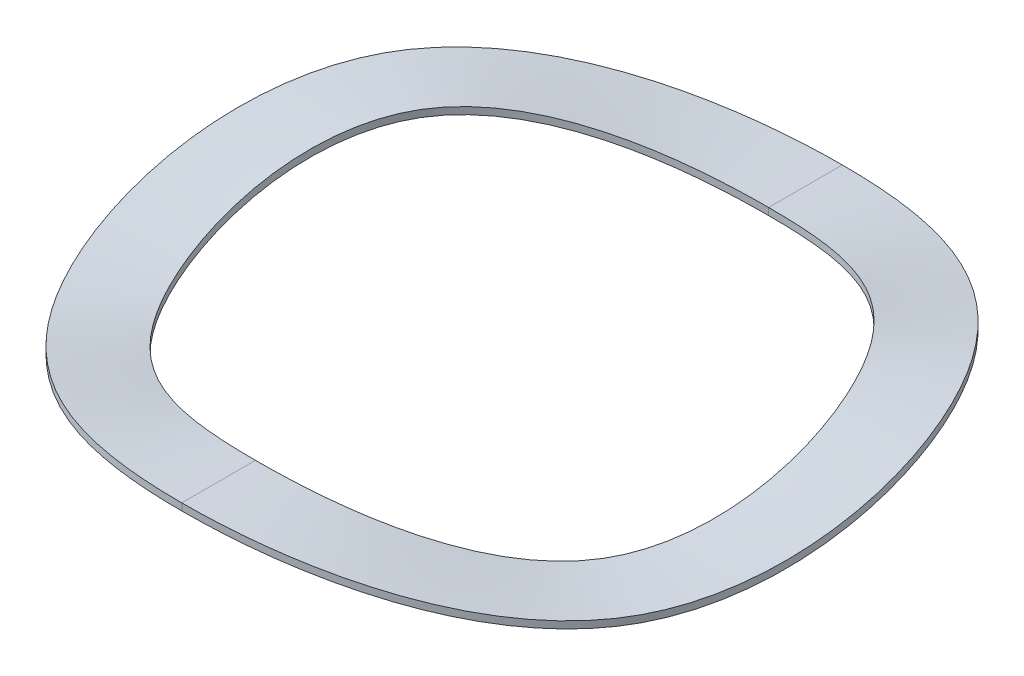
ISO-10303-21;
HEADER;
FILE_DESCRIPTION(('STEP AP214'),'2;1');
FILE_NAME('part.step','',(''),(''),'','','');
FILE_SCHEMA(('AUTOMOTIVE_DESIGN { 1 0 10303 214 1 1 1 1 }'));
ENDSEC;
DATA;
#1=APPLICATION_CONTEXT('core data for automotive mechanical design processes');
#2=APPLICATION_PROTOCOL_DEFINITION('international standard','automotive_design',2000,#1);
#3=PRODUCT_CONTEXT('',#1,'mechanical');
#4=PRODUCT('Part','Part','',(#3));
#5=PRODUCT_RELATED_PRODUCT_CATEGORY('part','',(#4));
#6=PRODUCT_DEFINITION_FORMATION('','',#4);
#7=PRODUCT_DEFINITION_CONTEXT('part definition',#1,'design');
#8=PRODUCT_DEFINITION('design','',#6,#7);
#9=PRODUCT_DEFINITION_SHAPE('','',#8);
#10=(LENGTH_UNIT() NAMED_UNIT(*) SI_UNIT(.MILLI.,.METRE.));
#11=(NAMED_UNIT(*) PLANE_ANGLE_UNIT() SI_UNIT($,.RADIAN.));
#12=(NAMED_UNIT(*) SI_UNIT($,.STERADIAN.) SOLID_ANGLE_UNIT());
#13=UNCERTAINTY_MEASURE_WITH_UNIT(LENGTH_MEASURE(1.E-05),#10,'distance_accuracy_value','');
#14=(GEOMETRIC_REPRESENTATION_CONTEXT(3) GLOBAL_UNCERTAINTY_ASSIGNED_CONTEXT((#13)) GLOBAL_UNIT_ASSIGNED_CONTEXT((#10,
#11,#12)) REPRESENTATION_CONTEXT('',''));
#15=CARTESIAN_POINT('',(0.,0.,0.));
#16=DIRECTION('',(0.,0.,1.));
#17=DIRECTION('',(1.,0.,0.));
#18=AXIS2_PLACEMENT_3D('',#15,#16,#17);
#19=CARTESIAN_POINT('',(0.,0.2921,-10.6553));
#20=CARTESIAN_POINT('',(3.69110419397773,0.2921,-10.6553));
#21=CARTESIAN_POINT('',(11.0733125819332,3.4163,-6.39318));
#22=CARTESIAN_POINT('',(11.0733125819332,-1.27,6.39318));
#23=CARTESIAN_POINT('',(3.69110419397772,1.8542,10.6553));
#24=CARTESIAN_POINT('',(0.,1.8542,10.6553));
#25=CARTESIAN_POINT('',(0.,0.194733333333333,-10.6553));
#26=CARTESIAN_POINT('',(3.69110419397773,0.194733333333332,-10.6553));
#27=CARTESIAN_POINT('',(11.0733125819332,3.31893333333334,-6.39318));
#28=CARTESIAN_POINT('',(11.0733125819332,-1.36736666666666,6.39318));
#29=CARTESIAN_POINT('',(3.69110419397772,1.75683333333333,10.6553));
#30=CARTESIAN_POINT('',(0.,1.75683333333333,10.6553));
#31=CARTESIAN_POINT('',(0.,0.0973666666666658,-10.6553));
#32=CARTESIAN_POINT('',(3.69110419397773,0.0973666666666655,-10.6553));
#33=CARTESIAN_POINT('',(11.0733125819332,3.22156666666667,-6.39318));
#34=CARTESIAN_POINT('',(11.0733125819332,-1.46473333333333,6.39318));
#35=CARTESIAN_POINT('',(3.69110419397772,1.65946666666667,10.6553));
#36=CARTESIAN_POINT('',(0.,1.65946666666667,10.6553));
#37=CARTESIAN_POINT('',(0.,0.,-10.6553));
#38=CARTESIAN_POINT('',(3.69110419397773,0.,-10.6553));
#39=CARTESIAN_POINT('',(11.0733125819332,3.1242,-6.39318));
#40=CARTESIAN_POINT('',(11.0733125819332,-1.5621,6.39318));
#41=CARTESIAN_POINT('',(3.69110419397772,1.5621,10.6553));
#42=CARTESIAN_POINT('',(0.,1.5621,10.6553));
#43=(BOUNDED_SURFACE() B_SPLINE_SURFACE(3,3,((#19,#20,#21,#22,#23,#24),(#25,#26,#27,#28,#29,
#30),(#31,#32,#33,#34,#35,#36),(#37,#38,#39,#40,#41,#42)),.UNSPECIFIED.,.F.,.F.,
.F.) B_SPLINE_SURFACE_WITH_KNOTS((4,4),(4,1,1,4),(0.,1.),(0.,0.166666666666668,
0.333333333333334,0.5),
.UNSPECIFIED.) GEOMETRIC_REPRESENTATION_ITEM() RATIONAL_B_SPLINE_SURFACE(((1.,1.,1.,1.,1.,1.),
(1.,1.,1.,1.,1.,1.),(1.,1.,1.,1.,1.,1.),(1.,1.,1.,1.,1.,1.))) REPRESENTATION_ITEM('') SURFACE());
#44=CARTESIAN_POINT('',(0.,1.8542,10.6553));
#45=CARTESIAN_POINT('',(0.,1.75683333333333,10.6553));
#46=CARTESIAN_POINT('',(0.,1.65946666666667,10.6553));
#47=CARTESIAN_POINT('',(0.,1.5621,10.6553));
#48=(BOUNDED_CURVE() B_SPLINE_CURVE(3,(#44,#45,#46,#47),.UNSPECIFIED.,.F.,
.F.) B_SPLINE_CURVE_WITH_KNOTS((4,4),(0.,1.),
.UNSPECIFIED.) CURVE() GEOMETRIC_REPRESENTATION_ITEM() RATIONAL_B_SPLINE_CURVE((1.,1.,1.,1.)) REPRESENTATION_ITEM(''));
#49=CARTESIAN_POINT('',(0.,1.8542,10.6553));
#50=VERTEX_POINT('',#49);
#51=CARTESIAN_POINT('',(0.,1.5621,10.6553));
#52=VERTEX_POINT('',#51);
#53=EDGE_CURVE('E118',#50,#52,#48,.T.);
#54=CARTESIAN_POINT('',(0.,0.2921,-10.6553));
#55=CARTESIAN_POINT('',(3.69110419397773,0.2921,-10.6553));
#56=CARTESIAN_POINT('',(11.0733125819332,3.4163,-6.39318));
#57=CARTESIAN_POINT('',(11.0733125819332,-1.27,6.39318));
#58=CARTESIAN_POINT('',(3.69110419397772,1.8542,10.6553));
#59=CARTESIAN_POINT('',(0.,1.8542,10.6553));
#60=(BOUNDED_CURVE() B_SPLINE_CURVE(3,(#54,#55,#56,#57,#58,#59),.UNSPECIFIED.,.F.,
.F.) B_SPLINE_CURVE_WITH_KNOTS((4,1,1,4),(0.,0.166666666666668,0.333333333333334,0.5),
.UNSPECIFIED.) CURVE() GEOMETRIC_REPRESENTATION_ITEM() RATIONAL_B_SPLINE_CURVE((1.,1.,1.,1.,1.,1.)) REPRESENTATION_ITEM(''));
#61=CARTESIAN_POINT('',(0.,0.2921,-10.6553));
#62=VERTEX_POINT('',#61);
#63=EDGE_CURVE('E11',#62,#50,#60,.T.);
#64=CARTESIAN_POINT('',(0.,0.2921,-10.6553));
#65=CARTESIAN_POINT('',(0.,0.194733333333333,-10.6553));
#66=CARTESIAN_POINT('',(0.,0.0973666666666658,-10.6553));
#67=CARTESIAN_POINT('',(0.,0.,-10.6553));
#68=(BOUNDED_CURVE() B_SPLINE_CURVE(3,(#64,#65,#66,#67),.UNSPECIFIED.,.F.,
.F.) B_SPLINE_CURVE_WITH_KNOTS((4,4),(0.,1.),
.UNSPECIFIED.) CURVE() GEOMETRIC_REPRESENTATION_ITEM() RATIONAL_B_SPLINE_CURVE((1.,1.,1.,1.)) REPRESENTATION_ITEM(''));
#69=CARTESIAN_POINT('',(0.,0.,-10.6553));
#70=VERTEX_POINT('',#69);
#71=EDGE_CURVE('E98',#62,#70,#68,.T.);
#72=CARTESIAN_POINT('',(0.,0.,-10.6553));
#73=CARTESIAN_POINT('',(3.69110419397773,0.,-10.6553));
#74=CARTESIAN_POINT('',(11.0733125819332,3.1242,-6.39318));
#75=CARTESIAN_POINT('',(11.0733125819332,-1.5621,6.39318));
#76=CARTESIAN_POINT('',(3.69110419397772,1.5621,10.6553));
#77=CARTESIAN_POINT('',(0.,1.5621,10.6553));
#78=(BOUNDED_CURVE() B_SPLINE_CURVE(3,(#72,#73,#74,#75,#76,#77),.UNSPECIFIED.,.F.,
.F.) B_SPLINE_CURVE_WITH_KNOTS((4,1,1,4),(0.,0.166666666666668,0.333333333333334,0.5),
.UNSPECIFIED.) CURVE() GEOMETRIC_REPRESENTATION_ITEM() RATIONAL_B_SPLINE_CURVE((1.,1.,1.,1.,1.,1.)) REPRESENTATION_ITEM(''));
#79=EDGE_CURVE('E31',#70,#52,#78,.T.);
#80=ORIENTED_EDGE('',*,*,#53,.F.);
#81=ORIENTED_EDGE('',*,*,#63,.F.);
#82=ORIENTED_EDGE('',*,*,#71,.T.);
#83=ORIENTED_EDGE('',*,*,#79,.T.);
#84=EDGE_LOOP('',(#80,#81,#82,#83));
#85=FACE_BOUND('',#84,.T.);
#86=ADVANCED_FACE('F16',(#85),#43,.T.);
#87=CARTESIAN_POINT('',(0.,0.2921,-13.716));
#88=CARTESIAN_POINT('',(4.75136177532294,0.2921,-13.716));
#89=CARTESIAN_POINT('',(14.2540853259689,3.4163,-8.2296));
#90=CARTESIAN_POINT('',(14.2540853259688,-1.27,8.2296));
#91=CARTESIAN_POINT('',(4.75136177532294,1.8542,13.716));
#92=CARTESIAN_POINT('',(0.,1.8542,13.716));
#93=CARTESIAN_POINT('',(0.,0.2921,-12.6957666666667));
#94=CARTESIAN_POINT('',(4.3979425815412,0.2921,-12.6957666666667));
#95=CARTESIAN_POINT('',(13.1938277446236,3.4163,-7.61746));
#96=CARTESIAN_POINT('',(13.1938277446236,-1.27,7.61746));
#97=CARTESIAN_POINT('',(4.3979425815412,1.8542,12.6957666666667));
#98=CARTESIAN_POINT('',(0.,1.8542,12.6957666666667));
#99=CARTESIAN_POINT('',(0.,0.2921,-11.6755333333333));
#100=CARTESIAN_POINT('',(4.04452338775946,0.2921,-11.6755333333333));
#101=CARTESIAN_POINT('',(12.1335701632784,3.4163,-7.00532));
#102=CARTESIAN_POINT('',(12.1335701632784,-1.27,7.00532));
#103=CARTESIAN_POINT('',(4.04452338775946,1.8542,11.6755333333333));
#104=CARTESIAN_POINT('',(0.,1.8542,11.6755333333333));
#105=CARTESIAN_POINT('',(0.,0.2921,-10.6553));
#106=CARTESIAN_POINT('',(3.69110419397773,0.2921,-10.6553));
#107=CARTESIAN_POINT('',(11.0733125819332,3.4163,-6.39318));
#108=CARTESIAN_POINT('',(11.0733125819332,-1.27,6.39318));
#109=CARTESIAN_POINT('',(3.69110419397772,1.8542,10.6553));
#110=CARTESIAN_POINT('',(0.,1.8542,10.6553));
#111=(BOUNDED_SURFACE() B_SPLINE_SURFACE(3,3,((#87,#88,#89,#90,#91,#92),(#93,#94,#95,#96,#97,
#98),(#99,#100,#101,#102,#103,#104),(#105,#106,#107,#108,#109,#110)),.UNSPECIFIED.,.F.,.F.,
.F.) B_SPLINE_SURFACE_WITH_KNOTS((4,4),(4,1,1,4),(0.,1.),(0.,0.166666666666668,
0.333333333333334,0.5),
.UNSPECIFIED.) GEOMETRIC_REPRESENTATION_ITEM() RATIONAL_B_SPLINE_SURFACE(((1.,1.,1.,1.,1.,1.),
(1.,1.,1.,1.,1.,1.),(1.,1.,1.,1.,1.,1.),(1.,1.,1.,1.,1.,1.))) REPRESENTATION_ITEM('') SURFACE());
#112=CARTESIAN_POINT('',(0.,1.8542,13.716));
#113=CARTESIAN_POINT('',(0.,1.8542,12.6957666666667));
#114=CARTESIAN_POINT('',(0.,1.8542,11.6755333333333));
#115=CARTESIAN_POINT('',(0.,1.8542,10.6553));
#116=(BOUNDED_CURVE() B_SPLINE_CURVE(3,(#112,#113,#114,#115),.UNSPECIFIED.,.F.,
.F.) B_SPLINE_CURVE_WITH_KNOTS((4,4),(0.,1.),
.UNSPECIFIED.) CURVE() GEOMETRIC_REPRESENTATION_ITEM() RATIONAL_B_SPLINE_CURVE((1.,1.,1.,1.)) REPRESENTATION_ITEM(''));
#117=CARTESIAN_POINT('',(0.,1.8542,13.716));
#118=VERTEX_POINT('',#117);
#119=EDGE_CURVE('E22',#118,#50,#116,.T.);
#120=CARTESIAN_POINT('',(0.,0.2921,-13.716));
#121=CARTESIAN_POINT('',(4.75136177532294,0.2921,-13.716));
#122=CARTESIAN_POINT('',(14.2540853259689,3.4163,-8.2296));
#123=CARTESIAN_POINT('',(14.2540853259688,-1.27,8.2296));
#124=CARTESIAN_POINT('',(4.75136177532294,1.8542,13.716));
#125=CARTESIAN_POINT('',(0.,1.8542,13.716));
#126=(BOUNDED_CURVE() B_SPLINE_CURVE(3,(#120,#121,#122,#123,#124,#125),.UNSPECIFIED.,.F.,
.F.) B_SPLINE_CURVE_WITH_KNOTS((4,1,1,4),(0.,0.166666666666668,0.333333333333334,0.5),
.UNSPECIFIED.) CURVE() GEOMETRIC_REPRESENTATION_ITEM() RATIONAL_B_SPLINE_CURVE((1.,1.,1.,1.,1.,1.)) REPRESENTATION_ITEM(''));
#127=CARTESIAN_POINT('',(0.,0.2921,-13.716));
#128=VERTEX_POINT('',#127);
#129=EDGE_CURVE('E67',#128,#118,#126,.T.);
#130=CARTESIAN_POINT('',(0.,0.2921,-13.716));
#131=CARTESIAN_POINT('',(0.,0.2921,-12.6957666666667));
#132=CARTESIAN_POINT('',(0.,0.2921,-11.6755333333333));
#133=CARTESIAN_POINT('',(0.,0.2921,-10.6553));
#134=(BOUNDED_CURVE() B_SPLINE_CURVE(3,(#130,#131,#132,#133),.UNSPECIFIED.,.F.,
.F.) B_SPLINE_CURVE_WITH_KNOTS((4,4),(0.,1.),
.UNSPECIFIED.) CURVE() GEOMETRIC_REPRESENTATION_ITEM() RATIONAL_B_SPLINE_CURVE((1.,1.,1.,1.)) REPRESENTATION_ITEM(''));
#135=EDGE_CURVE('E71',#128,#62,#134,.T.);
#136=ORIENTED_EDGE('',*,*,#119,.F.);
#137=ORIENTED_EDGE('',*,*,#129,.F.);
#138=ORIENTED_EDGE('',*,*,#135,.T.);
#139=ORIENTED_EDGE('',*,*,#63,.T.);
#140=EDGE_LOOP('',(#136,#137,#138,#139));
#141=FACE_BOUND('',#140,.T.);
#142=ADVANCED_FACE('F68',(#141),#111,.T.);
#143=CARTESIAN_POINT('',(0.,0.,-10.6553));
#144=CARTESIAN_POINT('',(3.69110419397773,0.,-10.6553));
#145=CARTESIAN_POINT('',(11.0733125819332,3.1242,-6.39318));
#146=CARTESIAN_POINT('',(11.0733125819332,-1.5621,6.39318));
#147=CARTESIAN_POINT('',(3.69110419397772,1.5621,10.6553));
#148=CARTESIAN_POINT('',(0.,1.5621,10.6553));
#149=CARTESIAN_POINT('',(0.,0.,-11.6755333333333));
#150=CARTESIAN_POINT('',(4.04452338775946,0.,-11.6755333333333));
#151=CARTESIAN_POINT('',(12.1335701632784,3.1242,-7.00532));
#152=CARTESIAN_POINT('',(12.1335701632784,-1.5621,7.00532));
#153=CARTESIAN_POINT('',(4.04452338775946,1.5621,11.6755333333333));
#154=CARTESIAN_POINT('',(0.,1.5621,11.6755333333333));
#155=CARTESIAN_POINT('',(0.,0.,-12.6957666666667));
#156=CARTESIAN_POINT('',(4.3979425815412,0.,-12.6957666666667));
#157=CARTESIAN_POINT('',(13.1938277446236,3.1242,-7.61746));
#158=CARTESIAN_POINT('',(13.1938277446236,-1.5621,7.61746));
#159=CARTESIAN_POINT('',(4.3979425815412,1.5621,12.6957666666667));
#160=CARTESIAN_POINT('',(0.,1.5621,12.6957666666667));
#161=CARTESIAN_POINT('',(0.,0.,-13.716));
#162=CARTESIAN_POINT('',(4.75136177532294,0.,-13.716));
#163=CARTESIAN_POINT('',(14.2540853259689,3.1242,-8.2296));
#164=CARTESIAN_POINT('',(14.2540853259688,-1.5621,8.2296));
#165=CARTESIAN_POINT('',(4.75136177532294,1.5621,13.716));
#166=CARTESIAN_POINT('',(0.,1.5621,13.716));
#167=(BOUNDED_SURFACE() B_SPLINE_SURFACE(3,3,((#143,#144,#145,#146,#147,#148),(#149,#150,#151,
#152,#153,#154),(#155,#156,#157,#158,#159,#160),(#161,#162,#163,#164,#165,#166)),.UNSPECIFIED.,
.F.,.F.,.F.) B_SPLINE_SURFACE_WITH_KNOTS((4,4),(4,1,1,4),(0.,1.),(0.,0.166666666666668,
0.333333333333334,0.5),
.UNSPECIFIED.) GEOMETRIC_REPRESENTATION_ITEM() RATIONAL_B_SPLINE_SURFACE(((1.,1.,1.,1.,1.,1.),
(1.,1.,1.,1.,1.,1.),(1.,1.,1.,1.,1.,1.),(1.,1.,1.,1.,1.,1.))) REPRESENTATION_ITEM('') SURFACE());
#168=CARTESIAN_POINT('',(0.,1.5621,10.6553));
#169=CARTESIAN_POINT('',(0.,1.5621,11.6755333333333));
#170=CARTESIAN_POINT('',(0.,1.5621,12.6957666666667));
#171=CARTESIAN_POINT('',(0.,1.5621,13.716));
#172=(BOUNDED_CURVE() B_SPLINE_CURVE(3,(#168,#169,#170,#171),.UNSPECIFIED.,.F.,
.F.) B_SPLINE_CURVE_WITH_KNOTS((4,4),(0.,1.),
.UNSPECIFIED.) CURVE() GEOMETRIC_REPRESENTATION_ITEM() RATIONAL_B_SPLINE_CURVE((1.,1.,1.,1.)) REPRESENTATION_ITEM(''));
#173=CARTESIAN_POINT('',(0.,1.5621,13.716));
#174=VERTEX_POINT('',#173);
#175=EDGE_CURVE('E94',#52,#174,#172,.T.);
#176=CARTESIAN_POINT('',(0.,0.,-10.6553));
#177=CARTESIAN_POINT('',(0.,0.,-11.6755333333333));
#178=CARTESIAN_POINT('',(0.,0.,-12.6957666666667));
#179=CARTESIAN_POINT('',(0.,0.,-13.716));
#180=(BOUNDED_CURVE() B_SPLINE_CURVE(3,(#176,#177,#178,#179),.UNSPECIFIED.,.F.,
.F.) B_SPLINE_CURVE_WITH_KNOTS((4,4),(0.,1.),
.UNSPECIFIED.) CURVE() GEOMETRIC_REPRESENTATION_ITEM() RATIONAL_B_SPLINE_CURVE((1.,1.,1.,1.)) REPRESENTATION_ITEM(''));
#181=CARTESIAN_POINT('',(0.,0.,-13.716));
#182=VERTEX_POINT('',#181);
#183=EDGE_CURVE('E144',#70,#182,#180,.T.);
#184=CARTESIAN_POINT('',(0.,1.5621,13.716));
#185=CARTESIAN_POINT('',(4.75136177532294,1.5621,13.716));
#186=CARTESIAN_POINT('',(14.2540853259688,-1.5621,8.2296));
#187=CARTESIAN_POINT('',(14.2540853259689,3.1242,-8.2296));
#188=CARTESIAN_POINT('',(4.75136177532294,0.,-13.716));
#189=CARTESIAN_POINT('',(0.,0.,-13.716));
#190=(BOUNDED_CURVE() B_SPLINE_CURVE(3,(#184,#185,#186,#187,#188,#189),.UNSPECIFIED.,.F.,
.F.) B_SPLINE_CURVE_WITH_KNOTS((4,1,1,4),(0.5,0.666666666666666,0.833333333333333,1.),
.UNSPECIFIED.) CURVE() GEOMETRIC_REPRESENTATION_ITEM() RATIONAL_B_SPLINE_CURVE((1.,1.,1.,1.,1.,1.)) REPRESENTATION_ITEM(''));
#191=EDGE_CURVE('E46',#174,#182,#190,.T.);
#192=ORIENTED_EDGE('',*,*,#175,.F.);
#193=ORIENTED_EDGE('',*,*,#79,.F.);
#194=ORIENTED_EDGE('',*,*,#183,.T.);
#195=ORIENTED_EDGE('',*,*,#191,.F.);
#196=EDGE_LOOP('',(#192,#193,#194,#195));
#197=FACE_BOUND('',#196,.T.);
#198=ADVANCED_FACE('F198',(#197),#167,.T.);
#199=CARTESIAN_POINT('',(0.,0.,-13.716));
#200=CARTESIAN_POINT('',(4.75136177532294,0.,-13.716));
#201=CARTESIAN_POINT('',(14.2540853259689,3.1242,-8.2296));
#202=CARTESIAN_POINT('',(14.2540853259688,-1.5621,8.2296));
#203=CARTESIAN_POINT('',(4.75136177532294,1.5621,13.716));
#204=CARTESIAN_POINT('',(0.,1.5621,13.716));
#205=CARTESIAN_POINT('',(0.,0.0973666666666665,-13.716));
#206=CARTESIAN_POINT('',(4.75136177532294,0.0973666666666662,-13.716));
#207=CARTESIAN_POINT('',(14.2540853259689,3.22156666666667,-8.2296));
#208=CARTESIAN_POINT('',(14.2540853259688,-1.46473333333333,8.2296));
#209=CARTESIAN_POINT('',(4.75136177532294,1.65946666666667,13.716));
#210=CARTESIAN_POINT('',(0.,1.65946666666667,13.716));
#211=CARTESIAN_POINT('',(0.,0.194733333333333,-13.716));
#212=CARTESIAN_POINT('',(4.75136177532294,0.194733333333333,-13.716));
#213=CARTESIAN_POINT('',(14.2540853259689,3.31893333333334,-8.2296));
#214=CARTESIAN_POINT('',(14.2540853259688,-1.36736666666666,8.2296));
#215=CARTESIAN_POINT('',(4.75136177532294,1.75683333333333,13.716));
#216=CARTESIAN_POINT('',(0.,1.75683333333333,13.716));
#217=CARTESIAN_POINT('',(0.,0.2921,-13.716));
#218=CARTESIAN_POINT('',(4.75136177532294,0.2921,-13.716));
#219=CARTESIAN_POINT('',(14.2540853259689,3.4163,-8.2296));
#220=CARTESIAN_POINT('',(14.2540853259688,-1.27,8.2296));
#221=CARTESIAN_POINT('',(4.75136177532294,1.8542,13.716));
#222=CARTESIAN_POINT('',(0.,1.8542,13.716));
#223=(BOUNDED_SURFACE() B_SPLINE_SURFACE(3,3,((#199,#200,#201,#202,#203,#204),(#205,#206,#207,
#208,#209,#210),(#211,#212,#213,#214,#215,#216),(#217,#218,#219,#220,#221,#222)),.UNSPECIFIED.,
.F.,.F.,.F.) B_SPLINE_SURFACE_WITH_KNOTS((4,4),(4,1,1,4),(0.,1.),(0.,0.166666666666668,
0.333333333333334,0.5),
.UNSPECIFIED.) GEOMETRIC_REPRESENTATION_ITEM() RATIONAL_B_SPLINE_SURFACE(((1.,1.,1.,1.,1.,1.),
(1.,1.,1.,1.,1.,1.),(1.,1.,1.,1.,1.,1.),(1.,1.,1.,1.,1.,1.))) REPRESENTATION_ITEM('') SURFACE());
#224=CARTESIAN_POINT('',(0.,1.5621,13.716));
#225=CARTESIAN_POINT('',(0.,1.65946666666667,13.716));
#226=CARTESIAN_POINT('',(0.,1.75683333333333,13.716));
#227=CARTESIAN_POINT('',(0.,1.8542,13.716));
#228=(BOUNDED_CURVE() B_SPLINE_CURVE(3,(#224,#225,#226,#227),.UNSPECIFIED.,.F.,
.F.) B_SPLINE_CURVE_WITH_KNOTS((4,4),(0.,1.),
.UNSPECIFIED.) CURVE() GEOMETRIC_REPRESENTATION_ITEM() RATIONAL_B_SPLINE_CURVE((1.,1.,1.,1.)) REPRESENTATION_ITEM(''));
#229=EDGE_CURVE('E85',#174,#118,#228,.T.);
#230=CARTESIAN_POINT('',(0.,0.,-13.716));
#231=CARTESIAN_POINT('',(0.,0.0973666666666665,-13.716));
#232=CARTESIAN_POINT('',(0.,0.194733333333333,-13.716));
#233=CARTESIAN_POINT('',(0.,0.2921,-13.716));
#234=(BOUNDED_CURVE() B_SPLINE_CURVE(3,(#230,#231,#232,#233),.UNSPECIFIED.,.F.,
.F.) B_SPLINE_CURVE_WITH_KNOTS((4,4),(0.,1.),
.UNSPECIFIED.) CURVE() GEOMETRIC_REPRESENTATION_ITEM() RATIONAL_B_SPLINE_CURVE((1.,1.,1.,1.)) REPRESENTATION_ITEM(''));
#235=EDGE_CURVE('E78',#182,#128,#234,.T.);
#236=ORIENTED_EDGE('',*,*,#229,.F.);
#237=ORIENTED_EDGE('',*,*,#191,.T.);
#238=ORIENTED_EDGE('',*,*,#235,.T.);
#239=ORIENTED_EDGE('',*,*,#129,.T.);
#240=EDGE_LOOP('',(#236,#237,#238,#239));
#241=FACE_BOUND('',#240,.T.);
#242=ADVANCED_FACE('F79',(#241),#223,.T.);
#243=CARTESIAN_POINT('',(0.,1.5621,13.716));
#244=CARTESIAN_POINT('',(-4.75136177532294,1.5621,13.716));
#245=CARTESIAN_POINT('',(-14.2540853259689,-1.5621,8.2296));
#246=CARTESIAN_POINT('',(-14.2540853259688,1.5621,-2.74320000000006));
#247=CARTESIAN_POINT('',(-9.50272355064585,1.5621,-10.9728));
#248=CARTESIAN_POINT('',(-4.75136177532294,0.,-13.716));
#249=CARTESIAN_POINT('',(0.,0.,-13.716));
#250=CARTESIAN_POINT('',(0.,1.65946666666667,13.716));
#251=CARTESIAN_POINT('',(-4.75136177532294,1.65946666666667,13.716));
#252=CARTESIAN_POINT('',(-14.2540853259689,-1.46473333333333,8.2296));
#253=CARTESIAN_POINT('',(-14.2540853259688,1.65946666666667,-2.74320000000006));
#254=CARTESIAN_POINT('',(-9.50272355064585,1.65946666666667,-10.9728));
#255=CARTESIAN_POINT('',(-4.75136177532294,0.0973666666666667,-13.716));
#256=CARTESIAN_POINT('',(0.,0.0973666666666665,-13.716));
#257=CARTESIAN_POINT('',(0.,1.75683333333333,13.716));
#258=CARTESIAN_POINT('',(-4.75136177532294,1.75683333333333,13.716));
#259=CARTESIAN_POINT('',(-14.2540853259689,-1.36736666666666,8.2296));
#260=CARTESIAN_POINT('',(-14.2540853259688,1.75683333333333,-2.74320000000006));
#261=CARTESIAN_POINT('',(-9.50272355064585,1.75683333333333,-10.9728));
#262=CARTESIAN_POINT('',(-4.75136177532294,0.194733333333333,-13.716));
#263=CARTESIAN_POINT('',(0.,0.194733333333333,-13.716));
#264=CARTESIAN_POINT('',(0.,1.8542,13.716));
#265=CARTESIAN_POINT('',(-4.75136177532294,1.8542,13.716));
#266=CARTESIAN_POINT('',(-14.2540853259689,-1.27,8.2296));
#267=CARTESIAN_POINT('',(-14.2540853259688,1.8542,-2.74320000000006));
#268=CARTESIAN_POINT('',(-9.50272355064585,1.8542,-10.9728));
#269=CARTESIAN_POINT('',(-4.75136177532294,0.2921,-13.716));
#270=CARTESIAN_POINT('',(0.,0.2921,-13.716));
#271=(BOUNDED_SURFACE() B_SPLINE_SURFACE(3,3,((#243,#244,#245,#246,#247,#248,#249),(#250,#251,
#252,#253,#254,#255,#256),(#257,#258,#259,#260,#261,#262,#263),(#264,#265,#266,#267,#268,#269,
#270)),.UNSPECIFIED.,.F.,.F.,.F.) B_SPLINE_SURFACE_WITH_KNOTS((4,4),(4,1,2,4),(0.,1.),(0.5,
0.666666666666666,0.833333333333333,1.),
.UNSPECIFIED.) GEOMETRIC_REPRESENTATION_ITEM() RATIONAL_B_SPLINE_SURFACE(((1.,1.,1.,1.,1.,1.,
1.),(1.,1.,1.,1.,1.,1.,1.),(1.,1.,1.,1.,1.,1.,1.),(1.,1.,1.,1.,1.,1.,1.))) REPRESENTATION_ITEM('') SURFACE());
#272=CARTESIAN_POINT('',(0.,0.,-13.716));
#273=CARTESIAN_POINT('',(-4.75136177532294,0.,-13.716));
#274=CARTESIAN_POINT('',(-9.50272355064585,1.5621,-10.9728));
#275=CARTESIAN_POINT('',(-14.2540853259688,1.5621,-2.74320000000006));
#276=CARTESIAN_POINT('',(-14.2540853259689,-1.5621,8.2296));
#277=CARTESIAN_POINT('',(-4.75136177532294,1.5621,13.716));
#278=CARTESIAN_POINT('',(0.,1.5621,13.716));
#279=(BOUNDED_CURVE() B_SPLINE_CURVE(3,(#272,#273,#274,#275,#276,#277,#278),.UNSPECIFIED.,.F.,
.F.) B_SPLINE_CURVE_WITH_KNOTS((4,2,1,4),(0.,0.166666666666667,0.333333333333334,0.5),
.UNSPECIFIED.) CURVE() GEOMETRIC_REPRESENTATION_ITEM() RATIONAL_B_SPLINE_CURVE((1.,1.,1.,1.,1.,
1.,1.)) REPRESENTATION_ITEM(''));
#280=EDGE_CURVE('E135',#182,#174,#279,.T.);
#281=CARTESIAN_POINT('',(0.,1.8542,13.716));
#282=CARTESIAN_POINT('',(-4.75136177532294,1.8542,13.716));
#283=CARTESIAN_POINT('',(-14.2540853259689,-1.27,8.2296));
#284=CARTESIAN_POINT('',(-14.2540853259688,1.8542,-2.74320000000006));
#285=CARTESIAN_POINT('',(-9.50272355064585,1.8542,-10.9728));
#286=CARTESIAN_POINT('',(-4.75136177532294,0.2921,-13.716));
#287=CARTESIAN_POINT('',(0.,0.2921,-13.716));
#288=(BOUNDED_CURVE() B_SPLINE_CURVE(3,(#281,#282,#283,#284,#285,#286,#287),.UNSPECIFIED.,.F.,
.F.) B_SPLINE_CURVE_WITH_KNOTS((4,1,2,4),(0.5,0.666666666666666,0.833333333333333,1.),
.UNSPECIFIED.) CURVE() GEOMETRIC_REPRESENTATION_ITEM() RATIONAL_B_SPLINE_CURVE((1.,1.,1.,1.,1.,
1.,1.)) REPRESENTATION_ITEM(''));
#289=EDGE_CURVE('E90',#118,#128,#288,.T.);
#290=ORIENTED_EDGE('',*,*,#280,.T.);
#291=ORIENTED_EDGE('',*,*,#229,.T.);
#292=ORIENTED_EDGE('',*,*,#289,.T.);
#293=ORIENTED_EDGE('',*,*,#235,.F.);
#294=EDGE_LOOP('',(#290,#291,#292,#293));
#295=FACE_BOUND('',#294,.T.);
#296=ADVANCED_FACE('F96',(#295),#271,.T.);
#297=CARTESIAN_POINT('',(0.,1.5621,10.6553));
#298=CARTESIAN_POINT('',(-3.69110419397773,1.5621,10.6553));
#299=CARTESIAN_POINT('',(-11.0733125819332,-1.5621,6.39318));
#300=CARTESIAN_POINT('',(-11.0733125819332,1.5621,-2.13106000000005));
#301=CARTESIAN_POINT('',(-7.38220838795543,1.5621,-8.52424));
#302=CARTESIAN_POINT('',(-3.69110419397772,0.,-10.6553));
#303=CARTESIAN_POINT('',(0.,0.,-10.6553));
#304=CARTESIAN_POINT('',(0.,1.5621,11.6755333333333));
#305=CARTESIAN_POINT('',(-4.04452338775947,1.5621,11.6755333333333));
#306=CARTESIAN_POINT('',(-12.1335701632785,-1.5621,7.00532));
#307=CARTESIAN_POINT('',(-12.1335701632784,1.5621,-2.33510666666672));
#308=CARTESIAN_POINT('',(-8.08904677551891,1.5621,-9.34042666666671));
#309=CARTESIAN_POINT('',(-4.04452338775946,0.,-11.6755333333333));
#310=CARTESIAN_POINT('',(0.,0.,-11.6755333333333));
#311=CARTESIAN_POINT('',(0.,1.5621,12.6957666666667));
#312=CARTESIAN_POINT('',(-4.3979425815412,1.5621,12.6957666666667));
#313=CARTESIAN_POINT('',(-13.1938277446237,-1.5621,7.61746));
#314=CARTESIAN_POINT('',(-13.1938277446236,1.5621,-2.53915333333339));
#315=CARTESIAN_POINT('',(-8.79588516308238,1.5621,-10.1566133333334));
#316=CARTESIAN_POINT('',(-4.3979425815412,0.,-12.6957666666667));
#317=CARTESIAN_POINT('',(0.,0.,-12.6957666666667));
#318=CARTESIAN_POINT('',(0.,1.5621,13.716));
#319=CARTESIAN_POINT('',(-4.75136177532294,1.5621,13.716));
#320=CARTESIAN_POINT('',(-14.2540853259689,-1.5621,8.2296));
#321=CARTESIAN_POINT('',(-14.2540853259688,1.5621,-2.74320000000006));
#322=CARTESIAN_POINT('',(-9.50272355064585,1.5621,-10.9728));
#323=CARTESIAN_POINT('',(-4.75136177532294,0.,-13.716));
#324=CARTESIAN_POINT('',(0.,0.,-13.716));
#325=(BOUNDED_SURFACE() B_SPLINE_SURFACE(3,3,((#297,#298,#299,#300,#301,#302,#303),(#304,#305,
#306,#307,#308,#309,#310),(#311,#312,#313,#314,#315,#316,#317),(#318,#319,#320,#321,#322,#323,
#324)),.UNSPECIFIED.,.F.,.F.,.F.) B_SPLINE_SURFACE_WITH_KNOTS((4,4),(4,1,2,4),(0.,1.),(0.5,
0.666666666666666,0.833333333333333,1.),
.UNSPECIFIED.) GEOMETRIC_REPRESENTATION_ITEM() RATIONAL_B_SPLINE_SURFACE(((1.,1.,1.,1.,1.,1.,
1.),(1.,1.,1.,1.,1.,1.,1.),(1.,1.,1.,1.,1.,1.,1.),(1.,1.,1.,1.,1.,1.,1.))) REPRESENTATION_ITEM('') SURFACE());
#326=CARTESIAN_POINT('',(0.,1.5621,10.6553));
#327=CARTESIAN_POINT('',(-3.69110419397773,1.5621,10.6553));
#328=CARTESIAN_POINT('',(-11.0733125819332,-1.5621,6.39318));
#329=CARTESIAN_POINT('',(-11.0733125819332,1.5621,-2.13106000000005));
#330=CARTESIAN_POINT('',(-7.38220838795543,1.5621,-8.52424));
#331=CARTESIAN_POINT('',(-3.69110419397772,0.,-10.6553));
#332=CARTESIAN_POINT('',(0.,0.,-10.6553));
#333=(BOUNDED_CURVE() B_SPLINE_CURVE(3,(#326,#327,#328,#329,#330,#331,#332),.UNSPECIFIED.,.F.,
.F.) B_SPLINE_CURVE_WITH_KNOTS((4,1,2,4),(0.5,0.666666666666666,0.833333333333333,1.),
.UNSPECIFIED.) CURVE() GEOMETRIC_REPRESENTATION_ITEM() RATIONAL_B_SPLINE_CURVE((1.,1.,1.,1.,1.,
1.,1.)) REPRESENTATION_ITEM(''));
#334=EDGE_CURVE('E106',#52,#70,#333,.T.);
#335=ORIENTED_EDGE('',*,*,#334,.F.);
#336=ORIENTED_EDGE('',*,*,#175,.T.);
#337=ORIENTED_EDGE('',*,*,#280,.F.);
#338=ORIENTED_EDGE('',*,*,#183,.F.);
#339=EDGE_LOOP('',(#335,#336,#337,#338));
#340=FACE_BOUND('',#339,.T.);
#341=ADVANCED_FACE('F201',(#340),#325,.T.);
#342=CARTESIAN_POINT('',(0.,1.8542,13.716));
#343=CARTESIAN_POINT('',(-4.75136177532294,1.8542,13.716));
#344=CARTESIAN_POINT('',(-14.2540853259689,-1.27,8.2296));
#345=CARTESIAN_POINT('',(-14.2540853259688,1.8542,-2.74320000000006));
#346=CARTESIAN_POINT('',(-9.50272355064585,1.8542,-10.9728));
#347=CARTESIAN_POINT('',(-4.75136177532294,0.2921,-13.716));
#348=CARTESIAN_POINT('',(0.,0.2921,-13.716));
#349=CARTESIAN_POINT('',(0.,1.8542,12.6957666666667));
#350=CARTESIAN_POINT('',(-4.3979425815412,1.8542,12.6957666666667));
#351=CARTESIAN_POINT('',(-13.1938277446237,-1.27,7.61746));
#352=CARTESIAN_POINT('',(-13.1938277446236,1.8542,-2.53915333333339));
#353=CARTESIAN_POINT('',(-8.79588516308238,1.8542,-10.1566133333334));
#354=CARTESIAN_POINT('',(-4.3979425815412,0.2921,-12.6957666666667));
#355=CARTESIAN_POINT('',(0.,0.2921,-12.6957666666667));
#356=CARTESIAN_POINT('',(0.,1.8542,11.6755333333333));
#357=CARTESIAN_POINT('',(-4.04452338775947,1.8542,11.6755333333333));
#358=CARTESIAN_POINT('',(-12.1335701632785,-1.27,7.00532));
#359=CARTESIAN_POINT('',(-12.1335701632784,1.8542,-2.33510666666672));
#360=CARTESIAN_POINT('',(-8.08904677551891,1.8542,-9.34042666666671));
#361=CARTESIAN_POINT('',(-4.04452338775946,0.2921,-11.6755333333333));
#362=CARTESIAN_POINT('',(0.,0.2921,-11.6755333333333));
#363=CARTESIAN_POINT('',(0.,1.8542,10.6553));
#364=CARTESIAN_POINT('',(-3.69110419397773,1.8542,10.6553));
#365=CARTESIAN_POINT('',(-11.0733125819332,-1.27,6.39318));
#366=CARTESIAN_POINT('',(-11.0733125819332,1.8542,-2.13106000000005));
#367=CARTESIAN_POINT('',(-7.38220838795543,1.8542,-8.52424));
#368=CARTESIAN_POINT('',(-3.69110419397772,0.2921,-10.6553));
#369=CARTESIAN_POINT('',(0.,0.2921,-10.6553));
#370=(BOUNDED_SURFACE() B_SPLINE_SURFACE(3,3,((#342,#343,#344,#345,#346,#347,#348),(#349,#350,
#351,#352,#353,#354,#355),(#356,#357,#358,#359,#360,#361,#362),(#363,#364,#365,#366,#367,#368,
#369)),.UNSPECIFIED.,.F.,.F.,.F.) B_SPLINE_SURFACE_WITH_KNOTS((4,4),(4,1,2,4),(0.,1.),(0.5,
0.666666666666666,0.833333333333333,1.),
.UNSPECIFIED.) GEOMETRIC_REPRESENTATION_ITEM() RATIONAL_B_SPLINE_SURFACE(((1.,1.,1.,1.,1.,1.,
1.),(1.,1.,1.,1.,1.,1.,1.),(1.,1.,1.,1.,1.,1.,1.),(1.,1.,1.,1.,1.,1.,1.))) REPRESENTATION_ITEM('') SURFACE());
#371=CARTESIAN_POINT('',(0.,1.8542,10.6553));
#372=CARTESIAN_POINT('',(-3.69110419397773,1.8542,10.6553));
#373=CARTESIAN_POINT('',(-11.0733125819332,-1.27,6.39318));
#374=CARTESIAN_POINT('',(-11.0733125819332,1.8542,-2.13106000000005));
#375=CARTESIAN_POINT('',(-7.38220838795543,1.8542,-8.52424));
#376=CARTESIAN_POINT('',(-3.69110419397772,0.2921,-10.6553));
#377=CARTESIAN_POINT('',(0.,0.2921,-10.6553));
#378=(BOUNDED_CURVE() B_SPLINE_CURVE(3,(#371,#372,#373,#374,#375,#376,#377),.UNSPECIFIED.,.F.,
.F.) B_SPLINE_CURVE_WITH_KNOTS((4,1,2,4),(0.5,0.666666666666666,0.833333333333333,1.),
.UNSPECIFIED.) CURVE() GEOMETRIC_REPRESENTATION_ITEM() RATIONAL_B_SPLINE_CURVE((1.,1.,1.,1.,1.,
1.,1.)) REPRESENTATION_ITEM(''));
#379=EDGE_CURVE('E92',#50,#62,#378,.T.);
#380=ORIENTED_EDGE('',*,*,#289,.F.);
#381=ORIENTED_EDGE('',*,*,#119,.T.);
#382=ORIENTED_EDGE('',*,*,#379,.T.);
#383=ORIENTED_EDGE('',*,*,#135,.F.);
#384=EDGE_LOOP('',(#380,#381,#382,#383));
#385=FACE_BOUND('',#384,.T.);
#386=ADVANCED_FACE('F89',(#385),#370,.T.);
#387=CARTESIAN_POINT('',(0.,1.8542,10.6553));
#388=CARTESIAN_POINT('',(-3.69110419397773,1.8542,10.6553));
#389=CARTESIAN_POINT('',(-11.0733125819332,-1.27,6.39318));
#390=CARTESIAN_POINT('',(-11.0733125819332,1.8542,-2.13106000000005));
#391=CARTESIAN_POINT('',(-7.38220838795543,1.8542,-8.52424));
#392=CARTESIAN_POINT('',(-3.69110419397772,0.2921,-10.6553));
#393=CARTESIAN_POINT('',(0.,0.2921,-10.6553));
#394=CARTESIAN_POINT('',(0.,1.75683333333333,10.6553));
#395=CARTESIAN_POINT('',(-3.69110419397773,1.75683333333333,10.6553));
#396=CARTESIAN_POINT('',(-11.0733125819332,-1.36736666666667,6.39318));
#397=CARTESIAN_POINT('',(-11.0733125819332,1.75683333333333,-2.13106000000005));
#398=CARTESIAN_POINT('',(-7.38220838795543,1.75683333333333,-8.52424));
#399=CARTESIAN_POINT('',(-3.69110419397772,0.194733333333333,-10.6553));
#400=CARTESIAN_POINT('',(0.,0.194733333333333,-10.6553));
#401=CARTESIAN_POINT('',(0.,1.65946666666667,10.6553));
#402=CARTESIAN_POINT('',(-3.69110419397773,1.65946666666667,10.6553));
#403=CARTESIAN_POINT('',(-11.0733125819332,-1.46473333333333,6.39318));
#404=CARTESIAN_POINT('',(-11.0733125819332,1.65946666666667,-2.13106000000005));
#405=CARTESIAN_POINT('',(-7.38220838795543,1.65946666666667,-8.52424));
#406=CARTESIAN_POINT('',(-3.69110419397772,0.0973666666666661,-10.6553));
#407=CARTESIAN_POINT('',(0.,0.0973666666666658,-10.6553));
#408=CARTESIAN_POINT('',(0.,1.5621,10.6553));
#409=CARTESIAN_POINT('',(-3.69110419397773,1.5621,10.6553));
#410=CARTESIAN_POINT('',(-11.0733125819332,-1.5621,6.39318));
#411=CARTESIAN_POINT('',(-11.0733125819332,1.5621,-2.13106000000005));
#412=CARTESIAN_POINT('',(-7.38220838795543,1.5621,-8.52424));
#413=CARTESIAN_POINT('',(-3.69110419397772,0.,-10.6553));
#414=CARTESIAN_POINT('',(0.,0.,-10.6553));
#415=(BOUNDED_SURFACE() B_SPLINE_SURFACE(3,3,((#387,#388,#389,#390,#391,#392,#393),(#394,#395,
#396,#397,#398,#399,#400),(#401,#402,#403,#404,#405,#406,#407),(#408,#409,#410,#411,#412,#413,
#414)),.UNSPECIFIED.,.F.,.F.,.F.) B_SPLINE_SURFACE_WITH_KNOTS((4,4),(4,1,2,4),(0.,1.),(0.5,
0.666666666666666,0.833333333333333,1.),
.UNSPECIFIED.) GEOMETRIC_REPRESENTATION_ITEM() RATIONAL_B_SPLINE_SURFACE(((1.,1.,1.,1.,1.,1.,
1.),(1.,1.,1.,1.,1.,1.,1.),(1.,1.,1.,1.,1.,1.,1.),(1.,1.,1.,1.,1.,1.,1.))) REPRESENTATION_ITEM('') SURFACE());
#416=ORIENTED_EDGE('',*,*,#379,.F.);
#417=ORIENTED_EDGE('',*,*,#53,.T.);
#418=ORIENTED_EDGE('',*,*,#334,.T.);
#419=ORIENTED_EDGE('',*,*,#71,.F.);
#420=EDGE_LOOP('',(#416,#417,#418,#419));
#421=FACE_BOUND('',#420,.T.);
#422=ADVANCED_FACE('F18',(#421),#415,.T.);
#423=CLOSED_SHELL('',(#86,#142,#198,#242,#296,#341,#386,#422));
#424=MANIFOLD_SOLID_BREP('B1',#423);
#425=ADVANCED_BREP_SHAPE_REPRESENTATION('',(#18,#424),#14);
#426=SHAPE_DEFINITION_REPRESENTATION(#9,#425);
ENDSEC;
END-ISO-10303-21;
